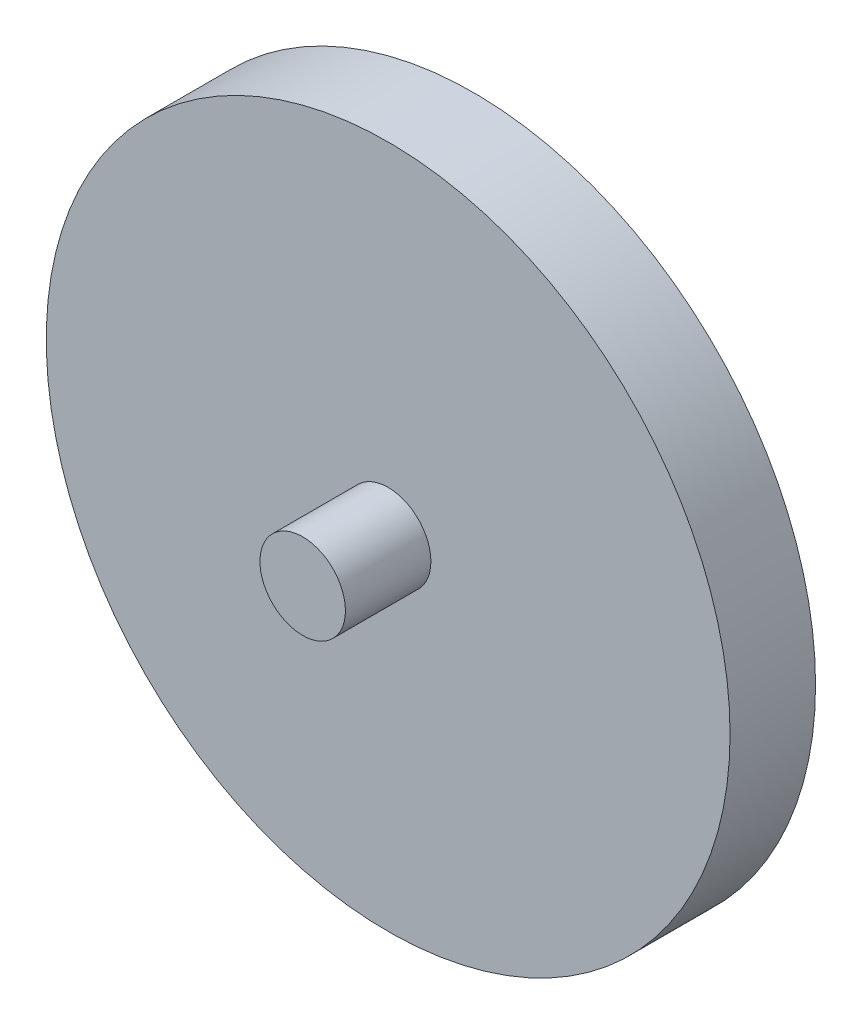
ISO-10303-21;
HEADER;
FILE_DESCRIPTION(('STEP AP214'),'2;1');
FILE_NAME('part.step','',(''),(''),'','','');
FILE_SCHEMA(('AUTOMOTIVE_DESIGN { 1 0 10303 214 1 1 1 1 }'));
ENDSEC;
DATA;
#1=APPLICATION_CONTEXT('core data for automotive mechanical design processes');
#2=APPLICATION_PROTOCOL_DEFINITION('international standard','automotive_design',2000,#1);
#3=PRODUCT_CONTEXT('',#1,'mechanical');
#4=PRODUCT('Part','Part','',(#3));
#5=PRODUCT_RELATED_PRODUCT_CATEGORY('part','',(#4));
#6=PRODUCT_DEFINITION_FORMATION('','',#4);
#7=PRODUCT_DEFINITION_CONTEXT('part definition',#1,'design');
#8=PRODUCT_DEFINITION('design','',#6,#7);
#9=PRODUCT_DEFINITION_SHAPE('','',#8);
#10=(LENGTH_UNIT() NAMED_UNIT(*) SI_UNIT(.MILLI.,.METRE.));
#11=(NAMED_UNIT(*) PLANE_ANGLE_UNIT() SI_UNIT($,.RADIAN.));
#12=(NAMED_UNIT(*) SI_UNIT($,.STERADIAN.) SOLID_ANGLE_UNIT());
#13=UNCERTAINTY_MEASURE_WITH_UNIT(LENGTH_MEASURE(1.E-05),#10,'distance_accuracy_value','');
#14=(GEOMETRIC_REPRESENTATION_CONTEXT(3) GLOBAL_UNCERTAINTY_ASSIGNED_CONTEXT((#13)) GLOBAL_UNIT_ASSIGNED_CONTEXT((#10,
#11,#12)) REPRESENTATION_CONTEXT('',''));
#15=CARTESIAN_POINT('',(0.,0.,0.));
#16=DIRECTION('',(0.,0.,1.));
#17=DIRECTION('',(1.,0.,0.));
#18=AXIS2_PLACEMENT_3D('',#15,#16,#17);
#19=CARTESIAN_POINT('',(0.,0.,5.));
#20=DIRECTION('',(0.,0.,-1.));
#21=DIRECTION('',(-1.,0.,0.));
#22=AXIS2_PLACEMENT_3D('',#19,#20,#21);
#23=CYLINDRICAL_SURFACE('',#22,20.);
#24=CARTESIAN_POINT('',(0.,0.,5.));
#25=DIRECTION('',(0.,0.,1.));
#26=DIRECTION('',(1.,0.,0.));
#27=AXIS2_PLACEMENT_3D('',#24,#25,#26);
#28=CIRCLE('',#27,20.);
#29=CARTESIAN_POINT('',(20.,0.,5.));
#30=VERTEX_POINT('',#29);
#31=EDGE_CURVE('E10',#30,#30,#28,.T.);
#32=ORIENTED_EDGE('',*,*,#31,.F.);
#33=EDGE_LOOP('',(#32));
#34=FACE_BOUND('',#33,.T.);
#35=CARTESIAN_POINT('',(0.,0.,0.));
#36=DIRECTION('',(0.,0.,1.));
#37=DIRECTION('',(1.,0.,0.));
#38=AXIS2_PLACEMENT_3D('',#35,#36,#37);
#39=CIRCLE('',#38,20.);
#40=CARTESIAN_POINT('',(20.,0.,0.));
#41=VERTEX_POINT('',#40);
#42=EDGE_CURVE('E37',#41,#41,#39,.T.);
#43=ORIENTED_EDGE('',*,*,#42,.T.);
#44=EDGE_LOOP('',(#43));
#45=FACE_BOUND('',#44,.T.);
#46=ADVANCED_FACE('F34',(#34,#45),#23,.T.);
#47=CARTESIAN_POINT('',(0.,0.,5.));
#48=DIRECTION('',(0.,0.,1.));
#49=DIRECTION('',(1.,0.,0.));
#50=AXIS2_PLACEMENT_3D('',#47,#48,#49);
#51=PLANE('',#50);
#52=CARTESIAN_POINT('',(0.,0.,5.));
#53=DIRECTION('',(0.,0.,1.));
#54=DIRECTION('',(1.,0.,0.));
#55=AXIS2_PLACEMENT_3D('',#52,#53,#54);
#56=CIRCLE('',#55,2.5);
#57=CARTESIAN_POINT('',(2.5,0.,5.));
#58=VERTEX_POINT('',#57);
#59=EDGE_CURVE('E46',#58,#58,#56,.T.);
#60=ORIENTED_EDGE('',*,*,#59,.F.);
#61=EDGE_LOOP('',(#60));
#62=FACE_BOUND('',#61,.T.);
#63=ORIENTED_EDGE('',*,*,#31,.T.);
#64=EDGE_LOOP('',(#63));
#65=FACE_BOUND('',#64,.T.);
#66=ADVANCED_FACE('F61',(#62,#65),#51,.T.);
#67=CARTESIAN_POINT('',(0.,0.,0.));
#68=DIRECTION('',(0.,0.,1.));
#69=DIRECTION('',(1.,0.,0.));
#70=AXIS2_PLACEMENT_3D('',#67,#68,#69);
#71=PLANE('',#70);
#72=ORIENTED_EDGE('',*,*,#42,.F.);
#73=EDGE_LOOP('',(#72));
#74=FACE_BOUND('',#73,.T.);
#75=ADVANCED_FACE('F57',(#74),#71,.F.);
#76=CARTESIAN_POINT('',(0.,0.,10.));
#77=DIRECTION('',(0.,0.,-1.));
#78=DIRECTION('',(-1.,0.,0.));
#79=AXIS2_PLACEMENT_3D('',#76,#77,#78);
#80=CYLINDRICAL_SURFACE('',#79,2.5);
#81=CARTESIAN_POINT('',(0.,0.,10.));
#82=DIRECTION('',(0.,0.,1.));
#83=DIRECTION('',(1.,0.,0.));
#84=AXIS2_PLACEMENT_3D('',#81,#82,#83);
#85=CIRCLE('',#84,2.5);
#86=CARTESIAN_POINT('',(2.5,0.,10.));
#87=VERTEX_POINT('',#86);
#88=EDGE_CURVE('E44',#87,#87,#85,.T.);
#89=ORIENTED_EDGE('',*,*,#88,.F.);
#90=EDGE_LOOP('',(#89));
#91=FACE_BOUND('',#90,.T.);
#92=ORIENTED_EDGE('',*,*,#59,.T.);
#93=EDGE_LOOP('',(#92));
#94=FACE_BOUND('',#93,.T.);
#95=ADVANCED_FACE('F54',(#91,#94),#80,.T.);
#96=CARTESIAN_POINT('',(0.,0.,10.));
#97=DIRECTION('',(0.,0.,1.));
#98=DIRECTION('',(1.,0.,0.));
#99=AXIS2_PLACEMENT_3D('',#96,#97,#98);
#100=PLANE('',#99);
#101=ORIENTED_EDGE('',*,*,#88,.T.);
#102=EDGE_LOOP('',(#101));
#103=FACE_BOUND('',#102,.T.);
#104=ADVANCED_FACE('F52',(#103),#100,.T.);
#105=CLOSED_SHELL('',(#46,#66,#75,#95,#104));
#106=MANIFOLD_SOLID_BREP('B2',#105);
#107=ADVANCED_BREP_SHAPE_REPRESENTATION('',(#18,#106),#14);
#108=SHAPE_DEFINITION_REPRESENTATION(#9,#107);
ENDSEC;
END-ISO-10303-21;
